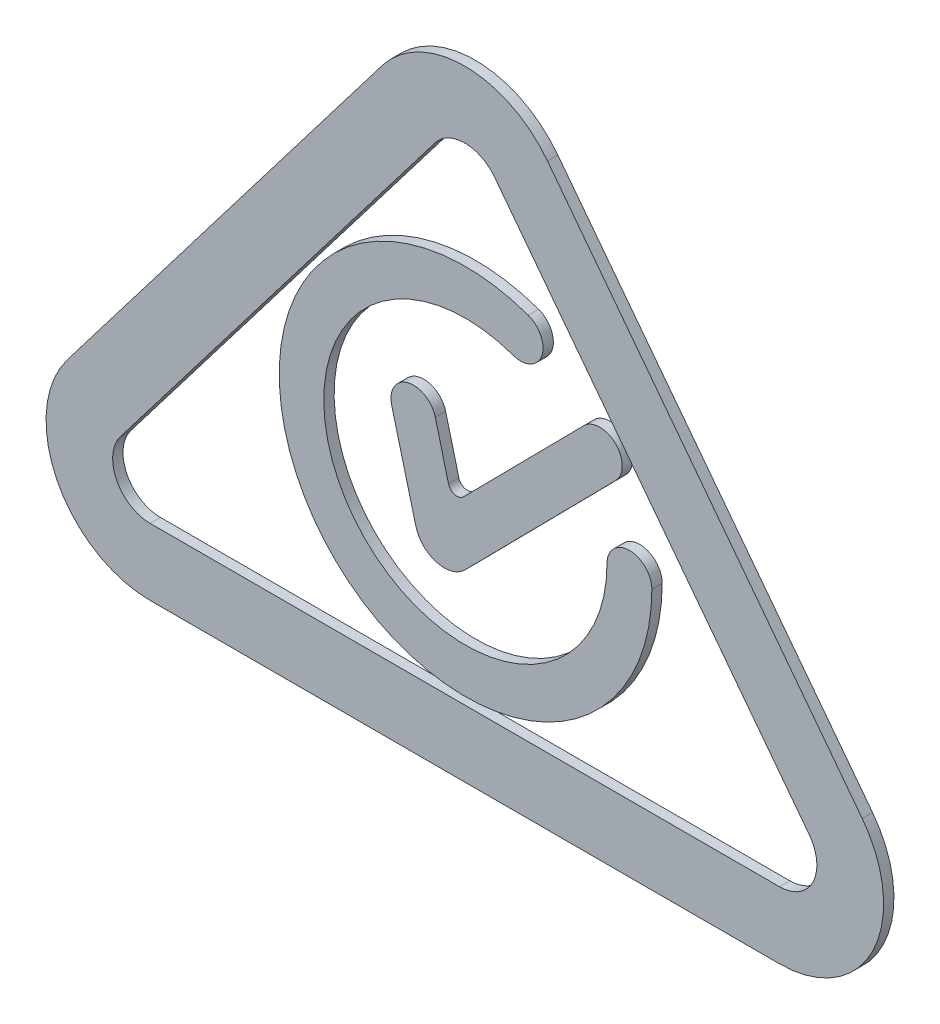
ISO-10303-21;
HEADER;
FILE_DESCRIPTION(('STEP AP214'),'2;1');
FILE_NAME('part.step','',(''),(''),'','','');
FILE_SCHEMA(('AUTOMOTIVE_DESIGN { 1 0 10303 214 1 1 1 1 }'));
ENDSEC;
DATA;
#1=APPLICATION_CONTEXT('core data for automotive mechanical design processes');
#2=APPLICATION_PROTOCOL_DEFINITION('international standard','automotive_design',2000,#1);
#3=PRODUCT_CONTEXT('',#1,'mechanical');
#4=PRODUCT('Part','Part','',(#3));
#5=PRODUCT_RELATED_PRODUCT_CATEGORY('part','',(#4));
#6=PRODUCT_DEFINITION_FORMATION('','',#4);
#7=PRODUCT_DEFINITION_CONTEXT('part definition',#1,'design');
#8=PRODUCT_DEFINITION('design','',#6,#7);
#9=PRODUCT_DEFINITION_SHAPE('','',#8);
#10=(LENGTH_UNIT() NAMED_UNIT(*) SI_UNIT(.MILLI.,.METRE.));
#11=(NAMED_UNIT(*) PLANE_ANGLE_UNIT() SI_UNIT($,.RADIAN.));
#12=(NAMED_UNIT(*) SI_UNIT($,.STERADIAN.) SOLID_ANGLE_UNIT());
#13=UNCERTAINTY_MEASURE_WITH_UNIT(LENGTH_MEASURE(1.E-05),#10,'distance_accuracy_value','');
#14=(GEOMETRIC_REPRESENTATION_CONTEXT(3) GLOBAL_UNCERTAINTY_ASSIGNED_CONTEXT((#13)) GLOBAL_UNIT_ASSIGNED_CONTEXT((#10,
#11,#12)) REPRESENTATION_CONTEXT('',''));
#15=CARTESIAN_POINT('',(0.,0.,0.));
#16=DIRECTION('',(0.,0.,1.));
#17=DIRECTION('',(1.,0.,0.));
#18=AXIS2_PLACEMENT_3D('',#15,#16,#17);
#19=CARTESIAN_POINT('',(-1.67,-0.647,0.));
#20=DIRECTION('',(0.794561478730577,-0.607183709034983,0.));
#21=DIRECTION('',(0.,0.,-1.));
#22=AXIS2_PLACEMENT_3D('',#19,#20,#21);
#23=PLANE('',#22);
#24=DIRECTION('',(0.,0.,1.));
#25=VECTOR('',#24,1.);
#26=CARTESIAN_POINT('',(-0.147,1.346,0.));
#27=LINE('',#26,#25);
#28=CARTESIAN_POINT('',(-0.147,1.346,0.));
#29=VERTEX_POINT('',#28);
#30=CARTESIAN_POINT('',(-0.147,1.346,0.05));
#31=VERTEX_POINT('',#30);
#32=EDGE_CURVE('P0_E180',#29,#31,#27,.T.);
#33=ORIENTED_EDGE('',*,*,#32,.T.);
#34=DIRECTION('',(0.607183709034983,0.794561478730577,0.));
#35=VECTOR('',#34,1.);
#36=CARTESIAN_POINT('',(-1.67,-0.647,0.05));
#37=LINE('',#36,#35);
#38=CARTESIAN_POINT('',(-1.67,-0.647,0.05));
#39=VERTEX_POINT('',#38);
#40=EDGE_CURVE('P0_E210',#39,#31,#37,.T.);
#41=ORIENTED_EDGE('',*,*,#40,.F.);
#42=DIRECTION('',(0.,0.,1.));
#43=VECTOR('',#42,1.);
#44=CARTESIAN_POINT('',(-1.67,-0.647,0.));
#45=LINE('',#44,#43);
#46=CARTESIAN_POINT('',(-1.67,-0.647,0.));
#47=VERTEX_POINT('',#46);
#48=EDGE_CURVE('P0_E11',#47,#39,#45,.T.);
#49=ORIENTED_EDGE('',*,*,#48,.F.);
#50=DIRECTION('',(0.607183709034983,0.794561478730577,0.));
#51=VECTOR('',#50,1.);
#52=CARTESIAN_POINT('',(-1.67,-0.647,0.));
#53=LINE('',#52,#51);
#54=EDGE_CURVE('P0_E237',#47,#29,#53,.T.);
#55=ORIENTED_EDGE('',*,*,#54,.T.);
#56=EDGE_LOOP('',(#33,#41,#49,#55));
#57=FACE_BOUND('',#56,.T.);
#58=ADVANCED_FACE('P0_F17',(#57),#23,.T.);
#59=CARTESIAN_POINT('',(-1.526059354807,-0.7569005054714,0.));
#60=DIRECTION('',(0.,0.,1.));
#61=DIRECTION('',(1.,0.,0.));
#62=AXIS2_PLACEMENT_3D('',#59,#60,#61);
#63=CYLINDRICAL_SURFACE('',#62,0.1810995042553);
#64=ORIENTED_EDGE('',*,*,#48,.T.);
#65=CARTESIAN_POINT('',(-1.526059354807,-0.7569005054714,0.05));
#66=DIRECTION('',(0.,0.,-1.));
#67=DIRECTION('',(0.000327746931416091,-0.999999946290973,0.));
#68=AXIS2_PLACEMENT_3D('',#65,#66,#67);
#69=CIRCLE('',#68,0.1810995042553);
#70=CARTESIAN_POINT('',(-1.526,-0.938,0.05));
#71=VERTEX_POINT('',#70);
#72=EDGE_CURVE('P0_E207',#71,#39,#69,.T.);
#73=ORIENTED_EDGE('',*,*,#72,.F.);
#74=DIRECTION('',(0.,0.,1.));
#75=VECTOR('',#74,1.);
#76=CARTESIAN_POINT('',(-1.526,-0.938,0.));
#77=LINE('',#76,#75);
#78=CARTESIAN_POINT('',(-1.526,-0.938,0.));
#79=VERTEX_POINT('',#78);
#80=EDGE_CURVE('P0_E27',#79,#71,#77,.T.);
#81=ORIENTED_EDGE('',*,*,#80,.F.);
#82=CARTESIAN_POINT('',(-1.526059354807,-0.7569005054714,0.));
#83=DIRECTION('',(0.,0.,-1.));
#84=DIRECTION('',(0.000327746931416091,-0.999999946290973,0.));
#85=AXIS2_PLACEMENT_3D('',#82,#83,#84);
#86=CIRCLE('',#85,0.1810995042553);
#87=EDGE_CURVE('P0_E218',#79,#47,#86,.T.);
#88=ORIENTED_EDGE('',*,*,#87,.T.);
#89=EDGE_LOOP('',(#64,#73,#81,#88));
#90=FACE_BOUND('',#89,.T.);
#91=ADVANCED_FACE('P0_F505',(#90),#63,.F.);
#92=CARTESIAN_POINT('',(1.52,-0.938,0.));
#93=DIRECTION('',(0.,1.,0.));
#94=DIRECTION('',(1.,0.,0.));
#95=AXIS2_PLACEMENT_3D('',#92,#93,#94);
#96=PLANE('',#95);
#97=ORIENTED_EDGE('',*,*,#80,.T.);
#98=DIRECTION('',(-1.,0.,0.));
#99=VECTOR('',#98,1.);
#100=CARTESIAN_POINT('',(1.52,-0.938,0.05));
#101=LINE('',#100,#99);
#102=CARTESIAN_POINT('',(1.52,-0.938,0.05));
#103=VERTEX_POINT('',#102);
#104=EDGE_CURVE('P0_E211',#103,#71,#101,.T.);
#105=ORIENTED_EDGE('',*,*,#104,.F.);
#106=DIRECTION('',(0.,0.,1.));
#107=VECTOR('',#106,1.);
#108=CARTESIAN_POINT('',(1.52,-0.938,0.));
#109=LINE('',#108,#107);
#110=CARTESIAN_POINT('',(1.52,-0.938,0.));
#111=VERTEX_POINT('',#110);
#112=EDGE_CURVE('P0_E241',#111,#103,#109,.T.);
#113=ORIENTED_EDGE('',*,*,#112,.F.);
#114=DIRECTION('',(-1.,0.,0.));
#115=VECTOR('',#114,1.);
#116=CARTESIAN_POINT('',(1.52,-0.938,0.));
#117=LINE('',#116,#115);
#118=EDGE_CURVE('P0_E213',#111,#79,#117,.T.);
#119=ORIENTED_EDGE('',*,*,#118,.T.);
#120=EDGE_LOOP('',(#97,#105,#113,#119));
#121=FACE_BOUND('',#120,.T.);
#122=ADVANCED_FACE('P0_F515',(#121),#96,.T.);
#123=CARTESIAN_POINT('',(1.519559354807,-0.7571477241834,0.));
#124=DIRECTION('',(0.,0.,1.));
#125=DIRECTION('',(1.,0.,0.));
#126=AXIS2_PLACEMENT_3D('',#123,#124,#125);
#127=CYLINDRICAL_SURFACE('',#126,0.1808528126301);
#128=ORIENTED_EDGE('',*,*,#112,.T.);
#129=CARTESIAN_POINT('',(1.519559354807,-0.7571477241834,0.05));
#130=DIRECTION('',(0.,0.,-1.));
#131=DIRECTION('',(0.793134721584714,0.609046232577411,0.));
#132=AXIS2_PLACEMENT_3D('',#129,#130,#131);
#133=CIRCLE('',#132,0.1808528126301);
#134=CARTESIAN_POINT('',(1.663,-0.647,0.05));
#135=VERTEX_POINT('',#134);
#136=EDGE_CURVE('P0_E220',#135,#103,#133,.T.);
#137=ORIENTED_EDGE('',*,*,#136,.F.);
#138=DIRECTION('',(0.,0.,1.));
#139=VECTOR('',#138,1.);
#140=CARTESIAN_POINT('',(1.663,-0.647,0.));
#141=LINE('',#140,#139);
#142=CARTESIAN_POINT('',(1.663,-0.647,0.));
#143=VERTEX_POINT('',#142);
#144=EDGE_CURVE('P0_E114',#143,#135,#141,.T.);
#145=ORIENTED_EDGE('',*,*,#144,.F.);
#146=CARTESIAN_POINT('',(1.519559354807,-0.7571477241834,0.));
#147=DIRECTION('',(0.,0.,-1.));
#148=DIRECTION('',(0.793134721584714,0.609046232577411,0.));
#149=AXIS2_PLACEMENT_3D('',#146,#147,#148);
#150=CIRCLE('',#149,0.1808528126301);
#151=EDGE_CURVE('P0_E217',#143,#111,#150,.T.);
#152=ORIENTED_EDGE('',*,*,#151,.T.);
#153=EDGE_LOOP('',(#128,#137,#145,#152));
#154=FACE_BOUND('',#153,.T.);
#155=ADVANCED_FACE('P0_F525',(#154),#127,.F.);
#156=CARTESIAN_POINT('',(0.141,1.346,0.));
#157=DIRECTION('',(-0.794753824615705,-0.606931922260404,0.));
#158=DIRECTION('',(-0.606931922260404,0.794753824615705,0.));
#159=AXIS2_PLACEMENT_3D('',#156,#157,#158);
#160=PLANE('',#159);
#161=ORIENTED_EDGE('',*,*,#144,.T.);
#162=DIRECTION('',(0.606931922260404,-0.794753824615705,0.));
#163=VECTOR('',#162,1.);
#164=CARTESIAN_POINT('',(0.141,1.346,0.05));
#165=LINE('',#164,#163);
#166=CARTESIAN_POINT('',(0.141,1.346,0.05));
#167=VERTEX_POINT('',#166);
#168=EDGE_CURVE('P0_E253',#167,#135,#165,.T.);
#169=ORIENTED_EDGE('',*,*,#168,.F.);
#170=DIRECTION('',(0.,0.,1.));
#171=VECTOR('',#170,1.);
#172=CARTESIAN_POINT('',(0.141,1.346,0.));
#173=LINE('',#172,#171);
#174=CARTESIAN_POINT('',(0.141,1.346,0.));
#175=VERTEX_POINT('',#174);
#176=EDGE_CURVE('P0_E190',#175,#167,#173,.T.);
#177=ORIENTED_EDGE('',*,*,#176,.F.);
#178=DIRECTION('',(0.606931922260404,-0.794753824615705,0.));
#179=VECTOR('',#178,1.);
#180=CARTESIAN_POINT('',(0.141,1.346,0.));
#181=LINE('',#180,#179);
#182=EDGE_CURVE('P0_E227',#175,#143,#181,.T.);
#183=ORIENTED_EDGE('',*,*,#182,.T.);
#184=EDGE_LOOP('',(#161,#169,#177,#183));
#185=FACE_BOUND('',#184,.T.);
#186=ADVANCED_FACE('P0_F536',(#185),#160,.T.);
#187=CARTESIAN_POINT('',(0.,0.,0.05));
#188=DIRECTION('',(0.,0.,1.));
#189=DIRECTION('',(1.,0.,0.));
#190=AXIS2_PLACEMENT_3D('',#187,#188,#189);
#191=PLANE('',#190);
#192=ORIENTED_EDGE('',*,*,#136,.T.);
#193=ORIENTED_EDGE('',*,*,#104,.T.);
#194=ORIENTED_EDGE('',*,*,#72,.T.);
#195=ORIENTED_EDGE('',*,*,#40,.T.);
#196=CARTESIAN_POINT('',(-0.003,1.235979293988,0.05));
#197=DIRECTION('',(0.,0.,-1.));
#198=DIRECTION('',(-0.794615885775513,0.607112505284809,0.));
#199=AXIS2_PLACEMENT_3D('',#196,#197,#198);
#200=CIRCLE('',#199,0.1812196340115);
#201=EDGE_CURVE('P0_E178',#31,#167,#200,.T.);
#202=ORIENTED_EDGE('',*,*,#201,.T.);
#203=ORIENTED_EDGE('',*,*,#168,.T.);
#204=EDGE_LOOP('',(#192,#193,#194,#195,#202,#203));
#205=FACE_BOUND('',#204,.T.);
#206=DIRECTION('',(-0.606991412962213,-0.794708389656317,0.));
#207=VECTOR('',#206,1.);
#208=CARTESIAN_POINT('',(-0.403,1.542,0.05));
#209=LINE('',#208,#207);
#210=CARTESIAN_POINT('',(-0.403,1.542,0.05));
#211=VERTEX_POINT('',#210);
#212=CARTESIAN_POINT('',(-1.926,-0.452,0.05));
#213=VERTEX_POINT('',#212);
#214=EDGE_CURVE('P0_E102',#211,#213,#209,.T.);
#215=ORIENTED_EDGE('',*,*,#214,.T.);
#216=CARTESIAN_POINT('',(-1.526127899652,-0.757675722943,0.05));
#217=DIRECTION('',(0.,0.,1.));
#218=DIRECTION('',(-0.794462150277437,0.607313668359729,0.));
#219=AXIS2_PLACEMENT_3D('',#216,#217,#218);
#220=CIRCLE('',#219,0.5033242933073);
#221=CARTESIAN_POINT('',(-1.526,-1.261,0.05));
#222=VERTEX_POINT('',#221);
#223=EDGE_CURVE('P0_E20',#213,#222,#220,.T.);
#224=ORIENTED_EDGE('',*,*,#223,.T.);
#225=DIRECTION('',(1.,0.,0.));
#226=VECTOR('',#225,1.);
#227=CARTESIAN_POINT('',(-1.526,-1.261,0.05));
#228=LINE('',#227,#226);
#229=CARTESIAN_POINT('',(1.52,-1.261,0.05));
#230=VERTEX_POINT('',#229);
#231=EDGE_CURVE('P0_E147',#222,#230,#228,.T.);
#232=ORIENTED_EDGE('',*,*,#231,.T.);
#233=CARTESIAN_POINT('',(1.520127899652,-0.757675722943,0.05));
#234=DIRECTION('',(0.,0.,1.));
#235=DIRECTION('',(-0.000254109833240999,-0.999999967714096,0.));
#236=AXIS2_PLACEMENT_3D('',#233,#234,#235);
#237=CIRCLE('',#236,0.5033242933073);
#238=CARTESIAN_POINT('',(1.92,-0.452,0.05));
#239=VERTEX_POINT('',#238);
#240=EDGE_CURVE('P0_E200',#230,#239,#237,.T.);
#241=ORIENTED_EDGE('',*,*,#240,.T.);
#242=DIRECTION('',(-0.606991412962213,0.794708389656317,0.));
#243=VECTOR('',#242,1.);
#244=CARTESIAN_POINT('',(1.92,-0.452,0.05));
#245=LINE('',#244,#243);
#246=CARTESIAN_POINT('',(0.397,1.542,0.05));
#247=VERTEX_POINT('',#246);
#248=EDGE_CURVE('P0_E188',#239,#247,#245,.T.);
#249=ORIENTED_EDGE('',*,*,#248,.T.);
#250=CARTESIAN_POINT('',(-0.003,1.236386927746,0.05));
#251=DIRECTION('',(0.,0.,1.));
#252=DIRECTION('',(0.794615885775513,0.607112505284809,0.));
#253=AXIS2_PLACEMENT_3D('',#250,#251,#252);
#254=CIRCLE('',#253,0.5033878722543);
#255=EDGE_CURVE('P0_E189',#247,#211,#254,.T.);
#256=ORIENTED_EDGE('',*,*,#255,.T.);
#257=EDGE_LOOP('',(#215,#224,#232,#241,#249,#256));
#258=FACE_BOUND('',#257,.T.);
#259=ADVANCED_FACE('P0_F281',(#205,#258),#191,.T.);
#260=CARTESIAN_POINT('',(-0.403,1.542,0.));
#261=DIRECTION('',(-0.794708389656317,0.606991412962213,0.));
#262=DIRECTION('',(0.,0.,1.));
#263=AXIS2_PLACEMENT_3D('',#260,#261,#262);
#264=PLANE('',#263);
#265=DIRECTION('',(0.,0.,1.));
#266=VECTOR('',#265,1.);
#267=CARTESIAN_POINT('',(-1.926,-0.452,0.));
#268=LINE('',#267,#266);
#269=CARTESIAN_POINT('',(-1.926,-0.452,0.));
#270=VERTEX_POINT('',#269);
#271=EDGE_CURVE('P0_E155',#270,#213,#268,.T.);
#272=ORIENTED_EDGE('',*,*,#271,.T.);
#273=ORIENTED_EDGE('',*,*,#214,.F.);
#274=DIRECTION('',(0.,0.,1.));
#275=VECTOR('',#274,1.);
#276=CARTESIAN_POINT('',(-0.403,1.542,0.));
#277=LINE('',#276,#275);
#278=CARTESIAN_POINT('',(-0.403,1.542,0.));
#279=VERTEX_POINT('',#278);
#280=EDGE_CURVE('P0_E196',#279,#211,#277,.T.);
#281=ORIENTED_EDGE('',*,*,#280,.F.);
#282=DIRECTION('',(-0.606991412962213,-0.794708389656317,0.));
#283=VECTOR('',#282,1.);
#284=CARTESIAN_POINT('',(-0.403,1.542,0.));
#285=LINE('',#284,#283);
#286=EDGE_CURVE('P0_E160',#279,#270,#285,.T.);
#287=ORIENTED_EDGE('',*,*,#286,.T.);
#288=EDGE_LOOP('',(#272,#273,#281,#287));
#289=FACE_BOUND('',#288,.T.);
#290=ADVANCED_FACE('P0_F552',(#289),#264,.T.);
#291=CARTESIAN_POINT('',(-1.526127899652,-0.757675722943,0.));
#292=DIRECTION('',(0.,0.,1.));
#293=DIRECTION('',(1.,0.,0.));
#294=AXIS2_PLACEMENT_3D('',#291,#292,#293);
#295=CYLINDRICAL_SURFACE('',#294,0.5033242933073);
#296=DIRECTION('',(0.,0.,1.));
#297=VECTOR('',#296,1.);
#298=CARTESIAN_POINT('',(-1.526,-1.261,0.));
#299=LINE('',#298,#297);
#300=CARTESIAN_POINT('',(-1.526,-1.261,0.));
#301=VERTEX_POINT('',#300);
#302=EDGE_CURVE('P0_E140',#301,#222,#299,.T.);
#303=ORIENTED_EDGE('',*,*,#302,.T.);
#304=ORIENTED_EDGE('',*,*,#223,.F.);
#305=ORIENTED_EDGE('',*,*,#271,.F.);
#306=CARTESIAN_POINT('',(-1.526127899652,-0.757675722943,0.));
#307=DIRECTION('',(0.,0.,1.));
#308=DIRECTION('',(-0.794462150277437,0.607313668359729,0.));
#309=AXIS2_PLACEMENT_3D('',#306,#307,#308);
#310=CIRCLE('',#309,0.5033242933073);
#311=EDGE_CURVE('P0_E153',#270,#301,#310,.T.);
#312=ORIENTED_EDGE('',*,*,#311,.T.);
#313=EDGE_LOOP('',(#303,#304,#305,#312));
#314=FACE_BOUND('',#313,.T.);
#315=ADVANCED_FACE('P0_F154',(#314),#295,.T.);
#316=CARTESIAN_POINT('',(-1.526,-1.261,0.));
#317=DIRECTION('',(0.,-1.,0.));
#318=DIRECTION('',(0.,0.,-1.));
#319=AXIS2_PLACEMENT_3D('',#316,#317,#318);
#320=PLANE('',#319);
#321=DIRECTION('',(0.,0.,1.));
#322=VECTOR('',#321,1.);
#323=CARTESIAN_POINT('',(1.52,-1.261,0.));
#324=LINE('',#323,#322);
#325=CARTESIAN_POINT('',(1.52,-1.261,0.));
#326=VERTEX_POINT('',#325);
#327=EDGE_CURVE('P0_E202',#326,#230,#324,.T.);
#328=ORIENTED_EDGE('',*,*,#327,.T.);
#329=ORIENTED_EDGE('',*,*,#231,.F.);
#330=ORIENTED_EDGE('',*,*,#302,.F.);
#331=DIRECTION('',(1.,0.,0.));
#332=VECTOR('',#331,1.);
#333=CARTESIAN_POINT('',(-1.526,-1.261,0.));
#334=LINE('',#333,#332);
#335=EDGE_CURVE('P0_E145',#301,#326,#334,.T.);
#336=ORIENTED_EDGE('',*,*,#335,.T.);
#337=EDGE_LOOP('',(#328,#329,#330,#336));
#338=FACE_BOUND('',#337,.T.);
#339=ADVANCED_FACE('P0_F143',(#338),#320,.T.);
#340=CARTESIAN_POINT('',(1.520127899652,-0.757675722943,0.));
#341=DIRECTION('',(0.,0.,1.));
#342=DIRECTION('',(1.,0.,0.));
#343=AXIS2_PLACEMENT_3D('',#340,#341,#342);
#344=CYLINDRICAL_SURFACE('',#343,0.5033242933073);
#345=DIRECTION('',(0.,0.,1.));
#346=VECTOR('',#345,1.);
#347=CARTESIAN_POINT('',(1.92,-0.452,0.));
#348=LINE('',#347,#346);
#349=CARTESIAN_POINT('',(1.92,-0.452,0.));
#350=VERTEX_POINT('',#349);
#351=EDGE_CURVE('P0_E199',#350,#239,#348,.T.);
#352=ORIENTED_EDGE('',*,*,#351,.T.);
#353=ORIENTED_EDGE('',*,*,#240,.F.);
#354=ORIENTED_EDGE('',*,*,#327,.F.);
#355=CARTESIAN_POINT('',(1.520127899652,-0.757675722943,0.));
#356=DIRECTION('',(0.,0.,1.));
#357=DIRECTION('',(-0.000254109833240999,-0.999999967714096,0.));
#358=AXIS2_PLACEMENT_3D('',#355,#356,#357);
#359=CIRCLE('',#358,0.5033242933073);
#360=EDGE_CURVE('P0_E165',#326,#350,#359,.T.);
#361=ORIENTED_EDGE('',*,*,#360,.T.);
#362=EDGE_LOOP('',(#352,#353,#354,#361));
#363=FACE_BOUND('',#362,.T.);
#364=ADVANCED_FACE('P0_F577',(#363),#344,.T.);
#365=CARTESIAN_POINT('',(1.92,-0.452,0.));
#366=DIRECTION('',(0.794708389656317,0.606991412962213,0.));
#367=DIRECTION('',(0.,0.,-1.));
#368=AXIS2_PLACEMENT_3D('',#365,#366,#367);
#369=PLANE('',#368);
#370=DIRECTION('',(0.,0.,1.));
#371=VECTOR('',#370,1.);
#372=CARTESIAN_POINT('',(0.397,1.542,0.));
#373=LINE('',#372,#371);
#374=CARTESIAN_POINT('',(0.397,1.542,0.));
#375=VERTEX_POINT('',#374);
#376=EDGE_CURVE('P0_E184',#375,#247,#373,.T.);
#377=ORIENTED_EDGE('',*,*,#376,.T.);
#378=ORIENTED_EDGE('',*,*,#248,.F.);
#379=ORIENTED_EDGE('',*,*,#351,.F.);
#380=DIRECTION('',(-0.606991412962213,0.794708389656317,0.));
#381=VECTOR('',#380,1.);
#382=CARTESIAN_POINT('',(1.92,-0.452,0.));
#383=LINE('',#382,#381);
#384=EDGE_CURVE('P0_E174',#350,#375,#383,.T.);
#385=ORIENTED_EDGE('',*,*,#384,.T.);
#386=EDGE_LOOP('',(#377,#378,#379,#385));
#387=FACE_BOUND('',#386,.T.);
#388=ADVANCED_FACE('P0_F586',(#387),#369,.T.);
#389=CARTESIAN_POINT('',(-0.003,1.236386927746,0.));
#390=DIRECTION('',(0.,0.,1.));
#391=DIRECTION('',(1.,0.,0.));
#392=AXIS2_PLACEMENT_3D('',#389,#390,#391);
#393=CYLINDRICAL_SURFACE('',#392,0.5033878722543);
#394=ORIENTED_EDGE('',*,*,#280,.T.);
#395=ORIENTED_EDGE('',*,*,#255,.F.);
#396=ORIENTED_EDGE('',*,*,#376,.F.);
#397=CARTESIAN_POINT('',(-0.003,1.236386927746,0.));
#398=DIRECTION('',(0.,0.,1.));
#399=DIRECTION('',(0.794615885775513,0.607112505284809,0.));
#400=AXIS2_PLACEMENT_3D('',#397,#398,#399);
#401=CIRCLE('',#400,0.5033878722543);
#402=EDGE_CURVE('P0_E238',#375,#279,#401,.T.);
#403=ORIENTED_EDGE('',*,*,#402,.T.);
#404=EDGE_LOOP('',(#394,#395,#396,#403));
#405=FACE_BOUND('',#404,.T.);
#406=ADVANCED_FACE('P0_F596',(#405),#393,.T.);
#407=CARTESIAN_POINT('',(0.,0.,0.));
#408=DIRECTION('',(0.,0.,1.));
#409=DIRECTION('',(1.,0.,0.));
#410=AXIS2_PLACEMENT_3D('',#407,#408,#409);
#411=PLANE('',#410);
#412=CARTESIAN_POINT('',(-0.003,1.235979293988,0.));
#413=DIRECTION('',(0.,0.,-1.));
#414=DIRECTION('',(-0.794615885775513,0.607112505284809,0.));
#415=AXIS2_PLACEMENT_3D('',#412,#413,#414);
#416=CIRCLE('',#415,0.1812196340115);
#417=EDGE_CURVE('P0_E183',#29,#175,#416,.T.);
#418=ORIENTED_EDGE('',*,*,#417,.F.);
#419=ORIENTED_EDGE('',*,*,#54,.F.);
#420=ORIENTED_EDGE('',*,*,#87,.F.);
#421=ORIENTED_EDGE('',*,*,#118,.F.);
#422=ORIENTED_EDGE('',*,*,#151,.F.);
#423=ORIENTED_EDGE('',*,*,#182,.F.);
#424=EDGE_LOOP('',(#418,#419,#420,#421,#422,#423));
#425=FACE_BOUND('',#424,.T.);
#426=ORIENTED_EDGE('',*,*,#384,.F.);
#427=ORIENTED_EDGE('',*,*,#360,.F.);
#428=ORIENTED_EDGE('',*,*,#335,.F.);
#429=ORIENTED_EDGE('',*,*,#311,.F.);
#430=ORIENTED_EDGE('',*,*,#286,.F.);
#431=ORIENTED_EDGE('',*,*,#402,.F.);
#432=EDGE_LOOP('',(#426,#427,#428,#429,#430,#431));
#433=FACE_BOUND('',#432,.T.);
#434=ADVANCED_FACE('P0_F163',(#425,#433),#411,.F.);
#435=CARTESIAN_POINT('',(-0.003,1.235979293988,0.));
#436=DIRECTION('',(0.,0.,1.));
#437=DIRECTION('',(1.,0.,0.));
#438=AXIS2_PLACEMENT_3D('',#435,#436,#437);
#439=CYLINDRICAL_SURFACE('',#438,0.1812196340115);
#440=ORIENTED_EDGE('',*,*,#176,.T.);
#441=ORIENTED_EDGE('',*,*,#201,.F.);
#442=ORIENTED_EDGE('',*,*,#32,.F.);
#443=ORIENTED_EDGE('',*,*,#417,.T.);
#444=EDGE_LOOP('',(#440,#441,#442,#443));
#445=FACE_BOUND('',#444,.T.);
#446=ADVANCED_FACE('P0_F288',(#445),#439,.F.);
#447=CLOSED_SHELL('',(#58,#91,#122,#155,#186,#259,#290,#315,#339,#364,#388,#406,#434,#446));
#448=MANIFOLD_SOLID_BREP('P0_B1',#447);
#449=CARTESIAN_POINT('',(0.,0.,0.05));
#450=DIRECTION('',(0.,0.,1.));
#451=DIRECTION('',(1.,0.,0.));
#452=AXIS2_PLACEMENT_3D('',#449,#450,#451);
#453=PLANE('',#452);
#454=CARTESIAN_POINT('',(-0.0002747590868853,-0.0004263804411362,0.05));
#455=DIRECTION('',(0.,0.,-1.));
#456=DIRECTION('',(0.999999806431379,0.000622203507349587,0.));
#457=AXIS2_PLACEMENT_3D('',#454,#455,#456);
#458=CIRCLE('',#457,0.6852748917346);
#459=CARTESIAN_POINT('',(0.685,0.,0.05));
#460=VERTEX_POINT('',#459);
#461=CARTESIAN_POINT('',(0.23,0.645,0.05));
#462=VERTEX_POINT('',#461);
#463=EDGE_CURVE('P1_E11',#460,#462,#458,.T.);
#464=ORIENTED_EDGE('',*,*,#463,.T.);
#465=CARTESIAN_POINT('',(0.267,0.747,0.05));
#466=DIRECTION('',(0.,0.,1.));
#467=DIRECTION('',(-0.341002962553982,-0.940062221094651,0.));
#468=AXIS2_PLACEMENT_3D('',#465,#466,#467);
#469=CIRCLE('',#468,0.1085034561662);
#470=CARTESIAN_POINT('',(0.304,0.849,0.05));
#471=VERTEX_POINT('',#470);
#472=EDGE_CURVE('P1_E69',#462,#471,#469,.T.);
#473=ORIENTED_EDGE('',*,*,#472,.T.);
#474=CARTESIAN_POINT('',(0.0004406659460998,8.247142022094E-05,0.05));
#475=DIRECTION('',(0.,0.,1.));
#476=DIRECTION('',(0.336704775068811,0.94161026674833,0.));
#477=AXIS2_PLACEMENT_3D('',#474,#475,#476);
#478=CIRCLE('',#477,0.901559337826);
#479=CARTESIAN_POINT('',(0.902,0.,0.05));
#480=VERTEX_POINT('',#479);
#481=EDGE_CURVE('P1_E21',#471,#480,#478,.T.);
#482=ORIENTED_EDGE('',*,*,#481,.T.);
#483=CARTESIAN_POINT('',(0.7935,0.,0.05));
#484=DIRECTION('',(0.,0.,1.));
#485=DIRECTION('',(1.,0.,0.));
#486=AXIS2_PLACEMENT_3D('',#483,#484,#485);
#487=CIRCLE('',#486,0.1085);
#488=EDGE_CURVE('P1_E66',#480,#460,#487,.T.);
#489=ORIENTED_EDGE('',*,*,#488,.T.);
#490=EDGE_LOOP('',(#464,#473,#482,#489));
#491=FACE_BOUND('',#490,.T.);
#492=ADVANCED_FACE('P1_F17',(#491),#453,.T.);
#493=CARTESIAN_POINT('',(-0.0002747590868853,-0.0004263804411362,0.));
#494=DIRECTION('',(0.,0.,1.));
#495=DIRECTION('',(1.,0.,0.));
#496=AXIS2_PLACEMENT_3D('',#493,#494,#495);
#497=CYLINDRICAL_SURFACE('',#496,0.6852748917346);
#498=DIRECTION('',(0.,0.,1.));
#499=VECTOR('',#498,1.);
#500=CARTESIAN_POINT('',(0.23,0.645,0.));
#501=LINE('',#500,#499);
#502=CARTESIAN_POINT('',(0.23,0.645,0.));
#503=VERTEX_POINT('',#502);
#504=EDGE_CURVE('P1_E28',#503,#462,#501,.T.);
#505=ORIENTED_EDGE('',*,*,#504,.T.);
#506=ORIENTED_EDGE('',*,*,#463,.F.);
#507=DIRECTION('',(0.,0.,1.));
#508=VECTOR('',#507,1.);
#509=CARTESIAN_POINT('',(0.685,0.,0.));
#510=LINE('',#509,#508);
#511=CARTESIAN_POINT('',(0.685,0.,0.));
#512=VERTEX_POINT('',#511);
#513=EDGE_CURVE('P1_E85',#512,#460,#510,.T.);
#514=ORIENTED_EDGE('',*,*,#513,.F.);
#515=CARTESIAN_POINT('',(-0.0002747590868853,-0.0004263804411362,0.));
#516=DIRECTION('',(0.,0.,-1.));
#517=DIRECTION('',(0.999999806431379,0.000622203507349587,0.));
#518=AXIS2_PLACEMENT_3D('',#515,#516,#517);
#519=CIRCLE('',#518,0.6852748917346);
#520=EDGE_CURVE('P1_E113',#512,#503,#519,.T.);
#521=ORIENTED_EDGE('',*,*,#520,.T.);
#522=EDGE_LOOP('',(#505,#506,#514,#521));
#523=FACE_BOUND('',#522,.T.);
#524=ADVANCED_FACE('P1_F128',(#523),#497,.F.);
#525=CARTESIAN_POINT('',(0.267,0.747,0.));
#526=DIRECTION('',(0.,0.,1.));
#527=DIRECTION('',(1.,0.,0.));
#528=AXIS2_PLACEMENT_3D('',#525,#526,#527);
#529=CYLINDRICAL_SURFACE('',#528,0.1085034561662);
#530=DIRECTION('',(0.,0.,1.));
#531=VECTOR('',#530,1.);
#532=CARTESIAN_POINT('',(0.304,0.849,0.));
#533=LINE('',#532,#531);
#534=CARTESIAN_POINT('',(0.304,0.849,0.));
#535=VERTEX_POINT('',#534);
#536=EDGE_CURVE('P1_E73',#535,#471,#533,.T.);
#537=ORIENTED_EDGE('',*,*,#536,.T.);
#538=ORIENTED_EDGE('',*,*,#472,.F.);
#539=ORIENTED_EDGE('',*,*,#504,.F.);
#540=CARTESIAN_POINT('',(0.267,0.747,0.));
#541=DIRECTION('',(0.,0.,1.));
#542=DIRECTION('',(-0.341002962553982,-0.940062221094651,0.));
#543=AXIS2_PLACEMENT_3D('',#540,#541,#542);
#544=CIRCLE('',#543,0.1085034561662);
#545=EDGE_CURVE('P1_E112',#503,#535,#544,.T.);
#546=ORIENTED_EDGE('',*,*,#545,.T.);
#547=EDGE_LOOP('',(#537,#538,#539,#546));
#548=FACE_BOUND('',#547,.T.);
#549=ADVANCED_FACE('P1_F124',(#548),#529,.T.);
#550=CARTESIAN_POINT('',(0.0004406659460998,8.247142022094E-05,0.));
#551=DIRECTION('',(0.,0.,1.));
#552=DIRECTION('',(1.,0.,0.));
#553=AXIS2_PLACEMENT_3D('',#550,#551,#552);
#554=CYLINDRICAL_SURFACE('',#553,0.901559337826);
#555=DIRECTION('',(0.,0.,1.));
#556=VECTOR('',#555,1.);
#557=CARTESIAN_POINT('',(0.902,0.,0.));
#558=LINE('',#557,#556);
#559=CARTESIAN_POINT('',(0.902,0.,0.));
#560=VERTEX_POINT('',#559);
#561=EDGE_CURVE('P1_E74',#560,#480,#558,.T.);
#562=ORIENTED_EDGE('',*,*,#561,.T.);
#563=ORIENTED_EDGE('',*,*,#481,.F.);
#564=ORIENTED_EDGE('',*,*,#536,.F.);
#565=CARTESIAN_POINT('',(0.0004406659460998,8.247142022094E-05,0.));
#566=DIRECTION('',(0.,0.,1.));
#567=DIRECTION('',(0.336704775068811,0.94161026674833,0.));
#568=AXIS2_PLACEMENT_3D('',#565,#566,#567);
#569=CIRCLE('',#568,0.901559337826);
#570=EDGE_CURVE('P1_E78',#535,#560,#569,.T.);
#571=ORIENTED_EDGE('',*,*,#570,.T.);
#572=EDGE_LOOP('',(#562,#563,#564,#571));
#573=FACE_BOUND('',#572,.T.);
#574=ADVANCED_FACE('P1_F76',(#573),#554,.T.);
#575=CARTESIAN_POINT('',(0.7935,0.,0.));
#576=DIRECTION('',(0.,0.,1.));
#577=DIRECTION('',(1.,0.,0.));
#578=AXIS2_PLACEMENT_3D('',#575,#576,#577);
#579=CYLINDRICAL_SURFACE('',#578,0.1085);
#580=ORIENTED_EDGE('',*,*,#513,.T.);
#581=ORIENTED_EDGE('',*,*,#488,.F.);
#582=ORIENTED_EDGE('',*,*,#561,.F.);
#583=CARTESIAN_POINT('',(0.7935,0.,0.));
#584=DIRECTION('',(0.,0.,1.));
#585=DIRECTION('',(1.,0.,0.));
#586=AXIS2_PLACEMENT_3D('',#583,#584,#585);
#587=CIRCLE('',#586,0.1085);
#588=EDGE_CURVE('P1_E93',#560,#512,#587,.T.);
#589=ORIENTED_EDGE('',*,*,#588,.T.);
#590=EDGE_LOOP('',(#580,#581,#582,#589));
#591=FACE_BOUND('',#590,.T.);
#592=ADVANCED_FACE('P1_F83',(#591),#579,.T.);
#593=CARTESIAN_POINT('',(0.,0.,0.));
#594=DIRECTION('',(0.,0.,1.));
#595=DIRECTION('',(1.,0.,0.));
#596=AXIS2_PLACEMENT_3D('',#593,#594,#595);
#597=PLANE('',#596);
#598=ORIENTED_EDGE('',*,*,#570,.F.);
#599=ORIENTED_EDGE('',*,*,#545,.F.);
#600=ORIENTED_EDGE('',*,*,#520,.F.);
#601=ORIENTED_EDGE('',*,*,#588,.F.);
#602=EDGE_LOOP('',(#598,#599,#600,#601));
#603=FACE_BOUND('',#602,.T.);
#604=ADVANCED_FACE('P1_F19',(#603),#597,.F.);
#605=CLOSED_SHELL('',(#492,#524,#549,#574,#592,#604));
#606=MANIFOLD_SOLID_BREP('P1_B1',#605);
#607=CARTESIAN_POINT('',(0.573,0.521,0.));
#608=DIRECTION('',(-0.711313849099324,0.702874532245624,0.));
#609=DIRECTION('',(0.,0.,1.));
#610=AXIS2_PLACEMENT_3D('',#607,#608,#609);
#611=PLANE('',#610);
#612=DIRECTION('',(0.,0.,1.));
#613=VECTOR('',#612,1.);
#614=CARTESIAN_POINT('',(-0.01,-0.069,0.));
#615=LINE('',#614,#613);
#616=CARTESIAN_POINT('',(-0.01,-0.069,0.));
#617=VERTEX_POINT('',#616);
#618=CARTESIAN_POINT('',(-0.01,-0.069,0.05));
#619=VERTEX_POINT('',#618);
#620=EDGE_CURVE('P2_E11',#617,#619,#615,.T.);
#621=ORIENTED_EDGE('',*,*,#620,.T.);
#622=DIRECTION('',(-0.702874532245624,-0.711313849099324,0.));
#623=VECTOR('',#622,1.);
#624=CARTESIAN_POINT('',(0.573,0.521,0.05));
#625=LINE('',#624,#623);
#626=CARTESIAN_POINT('',(0.573,0.521,0.05));
#627=VERTEX_POINT('',#626);
#628=EDGE_CURVE('P2_E164',#627,#619,#625,.T.);
#629=ORIENTED_EDGE('',*,*,#628,.F.);
#630=DIRECTION('',(0.,0.,1.));
#631=VECTOR('',#630,1.);
#632=CARTESIAN_POINT('',(0.573,0.521,0.));
#633=LINE('',#632,#631);
#634=CARTESIAN_POINT('',(0.573,0.521,0.));
#635=VERTEX_POINT('',#634);
#636=EDGE_CURVE('P2_E83',#635,#627,#633,.T.);
#637=ORIENTED_EDGE('',*,*,#636,.F.);
#638=DIRECTION('',(-0.702874532245624,-0.711313849099324,0.));
#639=VECTOR('',#638,1.);
#640=CARTESIAN_POINT('',(0.573,0.521,0.));
#641=LINE('',#640,#639);
#642=EDGE_CURVE('P2_E176',#635,#617,#641,.T.);
#643=ORIENTED_EDGE('',*,*,#642,.T.);
#644=EDGE_LOOP('',(#621,#629,#637,#643));
#645=FACE_BOUND('',#644,.T.);
#646=ADVANCED_FACE('P2_F17',(#645),#611,.T.);
#647=CARTESIAN_POINT('',(-0.04060719196449,-0.03906409586545,0.));
#648=DIRECTION('',(0.,0.,1.));
#649=DIRECTION('',(1.,0.,0.));
#650=AXIS2_PLACEMENT_3D('',#647,#648,#649);
#651=CYLINDRICAL_SURFACE('',#650,0.04281306525238);
#652=DIRECTION('',(0.,0.,1.));
#653=VECTOR('',#652,1.);
#654=CARTESIAN_POINT('',(-0.082,-0.05,0.));
#655=LINE('',#654,#653);
#656=CARTESIAN_POINT('',(-0.082,-0.05,0.));
#657=VERTEX_POINT('',#656);
#658=CARTESIAN_POINT('',(-0.082,-0.05,0.05));
#659=VERTEX_POINT('',#658);
#660=EDGE_CURVE('P2_E28',#657,#659,#655,.T.);
#661=ORIENTED_EDGE('',*,*,#660,.T.);
#662=CARTESIAN_POINT('',(-0.04060719196449,-0.03906409586545,0.05));
#663=DIRECTION('',(0.,0.,-1.));
#664=DIRECTION('',(0.714903074191707,-0.699223565471907,0.));
#665=AXIS2_PLACEMENT_3D('',#662,#663,#664);
#666=CIRCLE('',#665,0.04281306525238);
#667=EDGE_CURVE('P2_E160',#619,#659,#666,.T.);
#668=ORIENTED_EDGE('',*,*,#667,.F.);
#669=ORIENTED_EDGE('',*,*,#620,.F.);
#670=CARTESIAN_POINT('',(-0.04060719196449,-0.03906409586545,0.));
#671=DIRECTION('',(0.,0.,-1.));
#672=DIRECTION('',(0.714903074191707,-0.699223565471907,0.));
#673=AXIS2_PLACEMENT_3D('',#670,#671,#672);
#674=CIRCLE('',#673,0.04281306525238);
#675=EDGE_CURVE('P2_E130',#617,#657,#674,.T.);
#676=ORIENTED_EDGE('',*,*,#675,.T.);
#677=EDGE_LOOP('',(#661,#668,#669,#676));
#678=FACE_BOUND('',#677,.T.);
#679=ADVANCED_FACE('P2_F217',(#678),#651,.F.);
#680=CARTESIAN_POINT('',(-0.082,-0.05,0.));
#681=DIRECTION('',(0.968032150961975,0.250826144378793,0.));
#682=DIRECTION('',(0.,0.,-1.));
#683=AXIS2_PLACEMENT_3D('',#680,#681,#682);
#684=PLANE('',#683);
#685=DIRECTION('',(0.,0.,1.));
#686=VECTOR('',#685,1.);
#687=CARTESIAN_POINT('',(-0.146,0.197,0.));
#688=LINE('',#687,#686);
#689=CARTESIAN_POINT('',(-0.146,0.197,0.));
#690=VERTEX_POINT('',#689);
#691=CARTESIAN_POINT('',(-0.146,0.197,0.05));
#692=VERTEX_POINT('',#691);
#693=EDGE_CURVE('P2_E110',#690,#692,#688,.T.);
#694=ORIENTED_EDGE('',*,*,#693,.T.);
#695=DIRECTION('',(-0.250826144378793,0.968032150961975,0.));
#696=VECTOR('',#695,1.);
#697=CARTESIAN_POINT('',(-0.082,-0.05,0.05));
#698=LINE('',#697,#696);
#699=EDGE_CURVE('P2_E21',#659,#692,#698,.T.);
#700=ORIENTED_EDGE('',*,*,#699,.F.);
#701=ORIENTED_EDGE('',*,*,#660,.F.);
#702=DIRECTION('',(-0.250826144378793,0.968032150961975,0.));
#703=VECTOR('',#702,1.);
#704=CARTESIAN_POINT('',(-0.082,-0.05,0.));
#705=LINE('',#704,#703);
#706=EDGE_CURVE('P2_E125',#657,#690,#705,.T.);
#707=ORIENTED_EDGE('',*,*,#706,.T.);
#708=EDGE_LOOP('',(#694,#700,#701,#707));
#709=FACE_BOUND('',#708,.T.);
#710=ADVANCED_FACE('P2_F126',(#709),#684,.T.);
#711=CARTESIAN_POINT('',(-0.2515,0.1695,0.));
#712=DIRECTION('',(0.,0.,1.));
#713=DIRECTION('',(1.,0.,0.));
#714=AXIS2_PLACEMENT_3D('',#711,#712,#713);
#715=CYLINDRICAL_SURFACE('',#714,0.1090252264387);
#716=DIRECTION('',(0.,0.,1.));
#717=VECTOR('',#716,1.);
#718=CARTESIAN_POINT('',(-0.357,0.142,0.));
#719=LINE('',#718,#717);
#720=CARTESIAN_POINT('',(-0.357,0.142,0.));
#721=VERTEX_POINT('',#720);
#722=CARTESIAN_POINT('',(-0.357,0.142,0.05));
#723=VERTEX_POINT('',#722);
#724=EDGE_CURVE('P2_E122',#721,#723,#719,.T.);
#725=ORIENTED_EDGE('',*,*,#724,.T.);
#726=CARTESIAN_POINT('',(-0.2515,0.1695,0.05));
#727=DIRECTION('',(0.,0.,1.));
#728=DIRECTION('',(0.967665956276281,0.252235201872995,0.));
#729=AXIS2_PLACEMENT_3D('',#726,#727,#728);
#730=CIRCLE('',#729,0.1090252264387);
#731=EDGE_CURVE('P2_E117',#692,#723,#730,.T.);
#732=ORIENTED_EDGE('',*,*,#731,.F.);
#733=ORIENTED_EDGE('',*,*,#693,.F.);
#734=CARTESIAN_POINT('',(-0.2515,0.1695,0.));
#735=DIRECTION('',(0.,0.,1.));
#736=DIRECTION('',(0.967665956276281,0.252235201872995,0.));
#737=AXIS2_PLACEMENT_3D('',#734,#735,#736);
#738=CIRCLE('',#737,0.1090252264387);
#739=EDGE_CURVE('P2_E114',#690,#721,#738,.T.);
#740=ORIENTED_EDGE('',*,*,#739,.T.);
#741=EDGE_LOOP('',(#725,#732,#733,#740));
#742=FACE_BOUND('',#741,.T.);
#743=ADVANCED_FACE('P2_F112',(#742),#715,.T.);
#744=CARTESIAN_POINT('',(-0.357,0.142,0.));
#745=DIRECTION('',(-0.967548431647171,-0.252685639514993,0.));
#746=DIRECTION('',(-0.252685639514993,0.967548431647171,0.));
#747=AXIS2_PLACEMENT_3D('',#744,#745,#746);
#748=PLANE('',#747);
#749=DIRECTION('',(0.,0.,1.));
#750=VECTOR('',#749,1.);
#751=CARTESIAN_POINT('',(-0.24,-0.306,0.));
#752=LINE('',#751,#750);
#753=CARTESIAN_POINT('',(-0.24,-0.306,0.));
#754=VERTEX_POINT('',#753);
#755=CARTESIAN_POINT('',(-0.24,-0.306,0.05));
#756=VERTEX_POINT('',#755);
#757=EDGE_CURVE('P2_E42',#754,#756,#752,.T.);
#758=ORIENTED_EDGE('',*,*,#757,.T.);
#759=DIRECTION('',(0.252685639514993,-0.967548431647171,0.));
#760=VECTOR('',#759,1.);
#761=CARTESIAN_POINT('',(-0.357,0.142,0.05));
#762=LINE('',#761,#760);
#763=EDGE_CURVE('P2_E148',#723,#756,#762,.T.);
#764=ORIENTED_EDGE('',*,*,#763,.F.);
#765=ORIENTED_EDGE('',*,*,#724,.F.);
#766=DIRECTION('',(0.252685639514993,-0.967548431647171,0.));
#767=VECTOR('',#766,1.);
#768=CARTESIAN_POINT('',(-0.357,0.142,0.));
#769=LINE('',#768,#767);
#770=EDGE_CURVE('P2_E135',#721,#754,#769,.T.);
#771=ORIENTED_EDGE('',*,*,#770,.T.);
#772=EDGE_LOOP('',(#758,#764,#765,#771));
#773=FACE_BOUND('',#772,.T.);
#774=ADVANCED_FACE('P2_F232',(#773),#748,.T.);
#775=CARTESIAN_POINT('',(-0.1025509198785,-0.2709479835553,0.));
#776=DIRECTION('',(0.,0.,1.));
#777=DIRECTION('',(1.,0.,0.));
#778=AXIS2_PLACEMENT_3D('',#775,#776,#777);
#779=CYLINDRICAL_SURFACE('',#778,0.1418481352824);
#780=DIRECTION('',(0.,0.,1.));
#781=VECTOR('',#780,1.);
#782=CARTESIAN_POINT('',(-0.002,-0.371,0.));
#783=LINE('',#782,#781);
#784=CARTESIAN_POINT('',(-0.002,-0.371,0.));
#785=VERTEX_POINT('',#784);
#786=CARTESIAN_POINT('',(-0.002,-0.371,0.05));
#787=VERTEX_POINT('',#786);
#788=EDGE_CURVE('P2_E155',#785,#787,#783,.T.);
#789=ORIENTED_EDGE('',*,*,#788,.T.);
#790=CARTESIAN_POINT('',(-0.1025509198785,-0.2709479835553,0.05));
#791=DIRECTION('',(0.,0.,1.));
#792=DIRECTION('',(-0.968987571446548,-0.247109462348412,0.));
#793=AXIS2_PLACEMENT_3D('',#790,#791,#792);
#794=CIRCLE('',#793,0.1418481352824);
#795=EDGE_CURVE('P2_E196',#756,#787,#794,.T.);
#796=ORIENTED_EDGE('',*,*,#795,.F.);
#797=ORIENTED_EDGE('',*,*,#757,.F.);
#798=CARTESIAN_POINT('',(-0.1025509198785,-0.2709479835553,0.));
#799=DIRECTION('',(0.,0.,1.));
#800=DIRECTION('',(-0.968987571446548,-0.247109462348412,0.));
#801=AXIS2_PLACEMENT_3D('',#798,#799,#800);
#802=CIRCLE('',#801,0.1418481352824);
#803=EDGE_CURVE('P2_E144',#754,#785,#802,.T.);
#804=ORIENTED_EDGE('',*,*,#803,.T.);
#805=EDGE_LOOP('',(#789,#796,#797,#804));
#806=FACE_BOUND('',#805,.T.);
#807=ADVANCED_FACE('P2_F238',(#806),#779,.T.);
#808=CARTESIAN_POINT('',(0.,0.,0.05));
#809=DIRECTION('',(0.,0.,1.));
#810=DIRECTION('',(1.,0.,0.));
#811=AXIS2_PLACEMENT_3D('',#808,#809,#810);
#812=PLANE('',#811);
#813=ORIENTED_EDGE('',*,*,#628,.T.);
#814=ORIENTED_EDGE('',*,*,#667,.T.);
#815=ORIENTED_EDGE('',*,*,#699,.T.);
#816=ORIENTED_EDGE('',*,*,#731,.T.);
#817=ORIENTED_EDGE('',*,*,#763,.T.);
#818=ORIENTED_EDGE('',*,*,#795,.T.);
#819=DIRECTION('',(0.702273683817487,0.711907067683287,0.));
#820=VECTOR('',#819,1.);
#821=CARTESIAN_POINT('',(-0.002,-0.371,0.05));
#822=LINE('',#821,#820);
#823=CARTESIAN_POINT('',(0.727,0.368,0.05));
#824=VERTEX_POINT('',#823);
#825=EDGE_CURVE('P2_E151',#787,#824,#822,.T.);
#826=ORIENTED_EDGE('',*,*,#825,.T.);
#827=CARTESIAN_POINT('',(0.65,0.4445,0.05));
#828=DIRECTION('',(0.,0.,1.));
#829=DIRECTION('',(0.709406297145489,-0.704799762748489,0.));
#830=AXIS2_PLACEMENT_3D('',#827,#828,#829);
#831=CIRCLE('',#830,0.1085414667305);
#832=EDGE_CURVE('P2_E167',#824,#627,#831,.T.);
#833=ORIENTED_EDGE('',*,*,#832,.T.);
#834=EDGE_LOOP('',(#813,#814,#815,#816,#817,#818,#826,#833));
#835=FACE_BOUND('',#834,.T.);
#836=ADVANCED_FACE('P2_F216',(#835),#812,.T.);
#837=CARTESIAN_POINT('',(0.65,0.4445,0.));
#838=DIRECTION('',(0.,0.,1.));
#839=DIRECTION('',(1.,0.,0.));
#840=AXIS2_PLACEMENT_3D('',#837,#838,#839);
#841=CYLINDRICAL_SURFACE('',#840,0.1085414667305);
#842=ORIENTED_EDGE('',*,*,#636,.T.);
#843=ORIENTED_EDGE('',*,*,#832,.F.);
#844=DIRECTION('',(0.,0.,1.));
#845=VECTOR('',#844,1.);
#846=CARTESIAN_POINT('',(0.727,0.368,0.));
#847=LINE('',#846,#845);
#848=CARTESIAN_POINT('',(0.727,0.368,0.));
#849=VERTEX_POINT('',#848);
#850=EDGE_CURVE('P2_E156',#849,#824,#847,.T.);
#851=ORIENTED_EDGE('',*,*,#850,.F.);
#852=CARTESIAN_POINT('',(0.65,0.4445,0.));
#853=DIRECTION('',(0.,0.,1.));
#854=DIRECTION('',(0.709406297145489,-0.704799762748489,0.));
#855=AXIS2_PLACEMENT_3D('',#852,#853,#854);
#856=CIRCLE('',#855,0.1085414667305);
#857=EDGE_CURVE('P2_E174',#849,#635,#856,.T.);
#858=ORIENTED_EDGE('',*,*,#857,.T.);
#859=EDGE_LOOP('',(#842,#843,#851,#858));
#860=FACE_BOUND('',#859,.T.);
#861=ADVANCED_FACE('P2_F19',(#860),#841,.T.);
#862=CARTESIAN_POINT('',(0.,0.,0.));
#863=DIRECTION('',(0.,0.,1.));
#864=DIRECTION('',(1.,0.,0.));
#865=AXIS2_PLACEMENT_3D('',#862,#863,#864);
#866=PLANE('',#865);
#867=DIRECTION('',(0.702273683817487,0.711907067683287,0.));
#868=VECTOR('',#867,1.);
#869=CARTESIAN_POINT('',(-0.002,-0.371,0.));
#870=LINE('',#869,#868);
#871=EDGE_CURVE('P2_E159',#785,#849,#870,.T.);
#872=ORIENTED_EDGE('',*,*,#871,.F.);
#873=ORIENTED_EDGE('',*,*,#803,.F.);
#874=ORIENTED_EDGE('',*,*,#770,.F.);
#875=ORIENTED_EDGE('',*,*,#739,.F.);
#876=ORIENTED_EDGE('',*,*,#706,.F.);
#877=ORIENTED_EDGE('',*,*,#675,.F.);
#878=ORIENTED_EDGE('',*,*,#642,.F.);
#879=ORIENTED_EDGE('',*,*,#857,.F.);
#880=EDGE_LOOP('',(#872,#873,#874,#875,#876,#877,#878,#879));
#881=FACE_BOUND('',#880,.T.);
#882=ADVANCED_FACE('P2_F133',(#881),#866,.F.);
#883=CARTESIAN_POINT('',(-0.002,-0.371,0.));
#884=DIRECTION('',(0.711907067683287,-0.702273683817487,0.));
#885=DIRECTION('',(0.,0.,-1.));
#886=AXIS2_PLACEMENT_3D('',#883,#884,#885);
#887=PLANE('',#886);
#888=ORIENTED_EDGE('',*,*,#850,.T.);
#889=ORIENTED_EDGE('',*,*,#825,.F.);
#890=ORIENTED_EDGE('',*,*,#788,.F.);
#891=ORIENTED_EDGE('',*,*,#871,.T.);
#892=EDGE_LOOP('',(#888,#889,#890,#891));
#893=FACE_BOUND('',#892,.T.);
#894=ADVANCED_FACE('P2_F233',(#893),#887,.T.);
#895=CLOSED_SHELL('',(#646,#679,#710,#743,#774,#807,#836,#861,#882,#894));
#896=MANIFOLD_SOLID_BREP('P2_B1',#895);
#897=ADVANCED_BREP_SHAPE_REPRESENTATION('',(#18,#448,#606,#896),#14);
#898=SHAPE_DEFINITION_REPRESENTATION(#9,#897);
ENDSEC;
END-ISO-10303-21;
